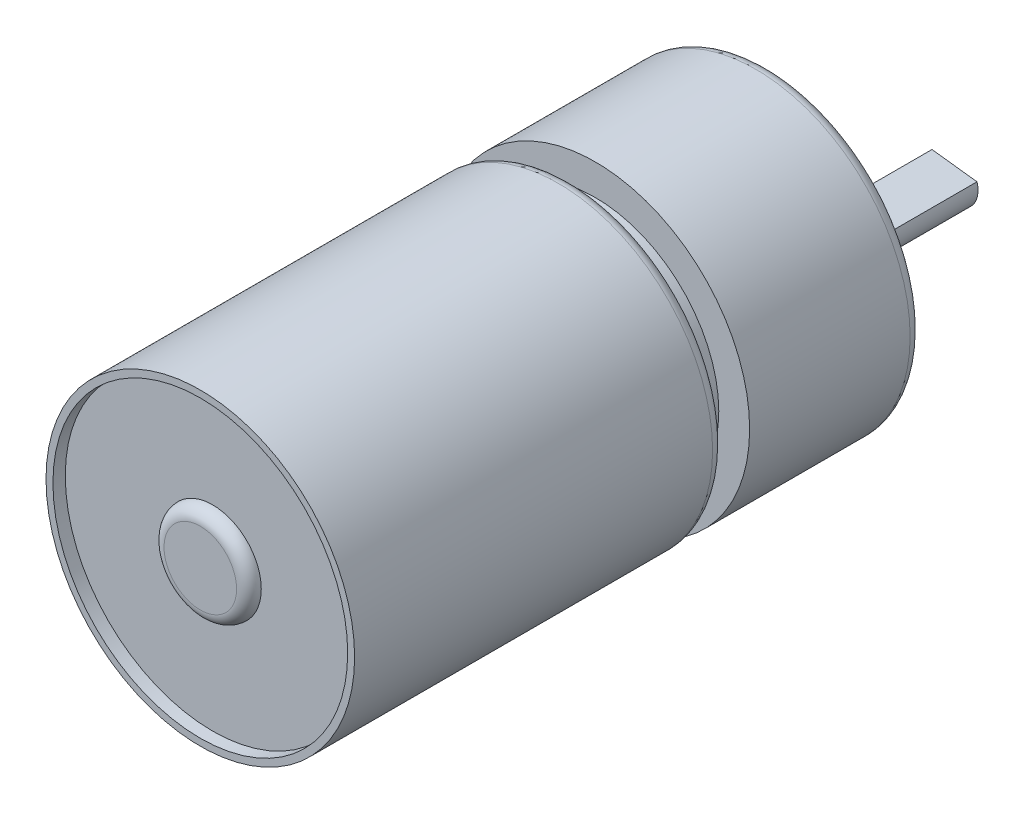
ISO-10303-21;
HEADER;
FILE_DESCRIPTION(('STEP AP214'),'2;1');
FILE_NAME('part.step','',(''),(''),'','','');
FILE_SCHEMA(('AUTOMOTIVE_DESIGN { 1 0 10303 214 1 1 1 1 }'));
ENDSEC;
DATA;
#1=APPLICATION_CONTEXT('core data for automotive mechanical design processes');
#2=APPLICATION_PROTOCOL_DEFINITION('international standard','automotive_design',2000,#1);
#3=PRODUCT_CONTEXT('',#1,'mechanical');
#4=PRODUCT('Part','Part','',(#3));
#5=PRODUCT_RELATED_PRODUCT_CATEGORY('part','',(#4));
#6=PRODUCT_DEFINITION_FORMATION('','',#4);
#7=PRODUCT_DEFINITION_CONTEXT('part definition',#1,'design');
#8=PRODUCT_DEFINITION('design','',#6,#7);
#9=PRODUCT_DEFINITION_SHAPE('','',#8);
#10=(LENGTH_UNIT() NAMED_UNIT(*) SI_UNIT(.MILLI.,.METRE.));
#11=(NAMED_UNIT(*) PLANE_ANGLE_UNIT() SI_UNIT($,.RADIAN.));
#12=(NAMED_UNIT(*) SI_UNIT($,.STERADIAN.) SOLID_ANGLE_UNIT());
#13=UNCERTAINTY_MEASURE_WITH_UNIT(LENGTH_MEASURE(1.E-05),#10,'distance_accuracy_value','');
#14=(GEOMETRIC_REPRESENTATION_CONTEXT(3) GLOBAL_UNCERTAINTY_ASSIGNED_CONTEXT((#13)) GLOBAL_UNIT_ASSIGNED_CONTEXT((#10,
#11,#12)) REPRESENTATION_CONTEXT('',''));
#15=CARTESIAN_POINT('',(0.,0.,0.));
#16=DIRECTION('',(0.,0.,1.));
#17=DIRECTION('',(1.,0.,0.));
#18=AXIS2_PLACEMENT_3D('',#15,#16,#17);
#19=CARTESIAN_POINT('',(0.,0.,14.));
#20=DIRECTION('',(0.,0.,-1.));
#21=DIRECTION('',(-1.,0.,0.));
#22=AXIS2_PLACEMENT_3D('',#19,#20,#21);
#23=CYLINDRICAL_SURFACE('',#22,12.5);
#24=CARTESIAN_POINT('',(0.,0.,0.999999999999999));
#25=DIRECTION('',(0.,0.,1.));
#26=DIRECTION('',(1.,0.,0.));
#27=AXIS2_PLACEMENT_3D('',#24,#25,#26);
#28=CIRCLE('',#27,12.5);
#29=CARTESIAN_POINT('',(12.5,0.,0.999999999999999));
#30=VERTEX_POINT('',#29);
#31=EDGE_CURVE('E144',#30,#30,#28,.T.);
#32=ORIENTED_EDGE('',*,*,#31,.T.);
#33=EDGE_LOOP('',(#32));
#34=FACE_BOUND('',#33,.T.);
#35=CARTESIAN_POINT('',(0.,0.,14.));
#36=DIRECTION('',(0.,0.,1.));
#37=DIRECTION('',(1.,0.,0.));
#38=AXIS2_PLACEMENT_3D('',#35,#36,#37);
#39=CIRCLE('',#38,12.5);
#40=CARTESIAN_POINT('',(12.5,0.,14.));
#41=VERTEX_POINT('',#40);
#42=EDGE_CURVE('E132',#41,#41,#39,.T.);
#43=ORIENTED_EDGE('',*,*,#42,.F.);
#44=EDGE_LOOP('',(#43));
#45=FACE_BOUND('',#44,.T.);
#46=ADVANCED_FACE('F42',(#34,#45),#23,.T.);
#47=CARTESIAN_POINT('',(0.,0.,14.));
#48=DIRECTION('',(0.,0.,1.));
#49=DIRECTION('',(1.,0.,0.));
#50=AXIS2_PLACEMENT_3D('',#47,#48,#49);
#51=PLANE('',#50);
#52=CARTESIAN_POINT('',(0.,0.,14.));
#53=DIRECTION('',(0.,0.,1.));
#54=DIRECTION('',(1.,0.,0.));
#55=AXIS2_PLACEMENT_3D('',#52,#53,#54);
#56=CIRCLE('',#55,10.);
#57=CARTESIAN_POINT('',(10.,0.,14.));
#58=VERTEX_POINT('',#57);
#59=EDGE_CURVE('E133',#58,#58,#56,.T.);
#60=ORIENTED_EDGE('',*,*,#59,.F.);
#61=EDGE_LOOP('',(#60));
#62=FACE_BOUND('',#61,.T.);
#63=ORIENTED_EDGE('',*,*,#42,.T.);
#64=EDGE_LOOP('',(#63));
#65=FACE_BOUND('',#64,.T.);
#66=ADVANCED_FACE('F190',(#62,#65),#51,.T.);
#67=CARTESIAN_POINT('',(0.,0.,0.));
#68=DIRECTION('',(0.,0.,1.));
#69=DIRECTION('',(1.,0.,0.));
#70=AXIS2_PLACEMENT_3D('',#67,#68,#69);
#71=PLANE('',#70);
#72=CARTESIAN_POINT('',(0.,-3.,0.));
#73=DIRECTION('',(0.,0.,1.));
#74=DIRECTION('',(1.,0.,0.));
#75=AXIS2_PLACEMENT_3D('',#72,#73,#74);
#76=CIRCLE('',#75,4.25);
#77=CARTESIAN_POINT('',(4.25,-3.,0.));
#78=VERTEX_POINT('',#77);
#79=EDGE_CURVE('E168',#78,#78,#76,.F.);
#80=ORIENTED_EDGE('',*,*,#79,.F.);
#81=EDGE_LOOP('',(#80));
#82=FACE_BOUND('',#81,.T.);
#83=CARTESIAN_POINT('',(9.49999999999999,0.,0.));
#84=DIRECTION('',(0.,0.,-1.));
#85=DIRECTION('',(-1.,0.,0.));
#86=AXIS2_PLACEMENT_3D('',#83,#84,#85);
#87=CIRCLE('',#86,1.);
#88=CARTESIAN_POINT('',(8.49999999999999,0.,0.));
#89=VERTEX_POINT('',#88);
#90=EDGE_CURVE('E106',#89,#89,#87,.T.);
#91=ORIENTED_EDGE('',*,*,#90,.F.);
#92=EDGE_LOOP('',(#91));
#93=FACE_BOUND('',#92,.T.);
#94=CARTESIAN_POINT('',(-9.5,0.,0.));
#95=DIRECTION('',(0.,0.,-1.));
#96=DIRECTION('',(-1.,0.,0.));
#97=AXIS2_PLACEMENT_3D('',#94,#95,#96);
#98=CIRCLE('',#97,1.);
#99=CARTESIAN_POINT('',(-10.5,0.,0.));
#100=VERTEX_POINT('',#99);
#101=EDGE_CURVE('E110',#100,#100,#98,.T.);
#102=ORIENTED_EDGE('',*,*,#101,.F.);
#103=EDGE_LOOP('',(#102));
#104=FACE_BOUND('',#103,.T.);
#105=CARTESIAN_POINT('',(0.,0.,0.));
#106=DIRECTION('',(0.,0.,1.));
#107=DIRECTION('',(1.,0.,0.));
#108=AXIS2_PLACEMENT_3D('',#105,#106,#107);
#109=CIRCLE('',#108,11.5);
#110=CARTESIAN_POINT('',(11.5,0.,0.));
#111=VERTEX_POINT('',#110);
#112=EDGE_CURVE('E148',#111,#111,#109,.F.);
#113=ORIENTED_EDGE('',*,*,#112,.T.);
#114=EDGE_LOOP('',(#113));
#115=FACE_BOUND('',#114,.T.);
#116=ADVANCED_FACE('F196',(#82,#93,#104,#115),#71,.F.);
#117=CARTESIAN_POINT('',(0.,0.,16.));
#118=DIRECTION('',(0.,0.,-1.));
#119=DIRECTION('',(-1.,0.,0.));
#120=AXIS2_PLACEMENT_3D('',#117,#118,#119);
#121=CYLINDRICAL_SURFACE('',#120,10.);
#122=CARTESIAN_POINT('',(0.,0.,15.));
#123=DIRECTION('',(0.,0.,1.));
#124=DIRECTION('',(1.,0.,0.));
#125=AXIS2_PLACEMENT_3D('',#122,#123,#124);
#126=CIRCLE('',#125,10.);
#127=CARTESIAN_POINT('',(10.,0.,15.));
#128=VERTEX_POINT('',#127);
#129=EDGE_CURVE('E164',#128,#128,#126,.F.);
#130=ORIENTED_EDGE('',*,*,#129,.T.);
#131=EDGE_LOOP('',(#130));
#132=FACE_BOUND('',#131,.T.);
#133=ORIENTED_EDGE('',*,*,#59,.T.);
#134=EDGE_LOOP('',(#133));
#135=FACE_BOUND('',#134,.T.);
#136=ADVANCED_FACE('F247',(#132,#135),#121,.T.);
#137=CARTESIAN_POINT('',(0.,0.,46.));
#138=DIRECTION('',(0.,0.,-1.));
#139=DIRECTION('',(-1.,0.,0.));
#140=AXIS2_PLACEMENT_3D('',#137,#138,#139);
#141=CYLINDRICAL_SURFACE('',#140,12.5);
#142=CARTESIAN_POINT('',(0.,0.,17.));
#143=DIRECTION('',(0.,0.,1.));
#144=DIRECTION('',(1.,0.,0.));
#145=AXIS2_PLACEMENT_3D('',#142,#143,#144);
#146=CIRCLE('',#145,12.5);
#147=CARTESIAN_POINT('',(12.5,0.,17.));
#148=VERTEX_POINT('',#147);
#149=EDGE_CURVE('E152',#148,#148,#146,.T.);
#150=ORIENTED_EDGE('',*,*,#149,.T.);
#151=EDGE_LOOP('',(#150));
#152=FACE_BOUND('',#151,.T.);
#153=CARTESIAN_POINT('',(0.,0.,46.));
#154=DIRECTION('',(0.,0.,1.));
#155=DIRECTION('',(1.,0.,0.));
#156=AXIS2_PLACEMENT_3D('',#153,#154,#155);
#157=CIRCLE('',#156,12.5);
#158=CARTESIAN_POINT('',(12.5,0.,46.));
#159=VERTEX_POINT('',#158);
#160=EDGE_CURVE('E125',#159,#159,#157,.T.);
#161=ORIENTED_EDGE('',*,*,#160,.F.);
#162=EDGE_LOOP('',(#161));
#163=FACE_BOUND('',#162,.T.);
#164=ADVANCED_FACE('F241',(#152,#163),#141,.T.);
#165=CARTESIAN_POINT('',(0.,0.,46.));
#166=DIRECTION('',(0.,0.,1.));
#167=DIRECTION('',(1.,0.,0.));
#168=AXIS2_PLACEMENT_3D('',#165,#166,#167);
#169=PLANE('',#168);
#170=CARTESIAN_POINT('',(0.,0.,46.));
#171=DIRECTION('',(0.,0.,1.));
#172=DIRECTION('',(1.,0.,0.));
#173=AXIS2_PLACEMENT_3D('',#170,#171,#172);
#174=CIRCLE('',#173,11.938790888998);
#175=CARTESIAN_POINT('',(11.938790888998,0.,46.));
#176=VERTEX_POINT('',#175);
#177=EDGE_CURVE('E120',#176,#176,#174,.T.);
#178=ORIENTED_EDGE('',*,*,#177,.F.);
#179=EDGE_LOOP('',(#178));
#180=FACE_BOUND('',#179,.T.);
#181=ORIENTED_EDGE('',*,*,#160,.T.);
#182=EDGE_LOOP('',(#181));
#183=FACE_BOUND('',#182,.T.);
#184=ADVANCED_FACE('F231',(#180,#183),#169,.T.);
#185=CARTESIAN_POINT('',(0.,0.,16.));
#186=DIRECTION('',(0.,0.,1.));
#187=DIRECTION('',(1.,0.,0.));
#188=AXIS2_PLACEMENT_3D('',#185,#186,#187);
#189=PLANE('',#188);
#190=CARTESIAN_POINT('',(0.,0.,16.));
#191=DIRECTION('',(0.,0.,1.));
#192=DIRECTION('',(1.,0.,0.));
#193=AXIS2_PLACEMENT_3D('',#190,#191,#192);
#194=CIRCLE('',#193,11.5);
#195=CARTESIAN_POINT('',(11.5,0.,16.));
#196=VERTEX_POINT('',#195);
#197=EDGE_CURVE('E160',#196,#196,#194,.F.);
#198=ORIENTED_EDGE('',*,*,#197,.T.);
#199=EDGE_LOOP('',(#198));
#200=FACE_BOUND('',#199,.T.);
#201=CARTESIAN_POINT('',(0.,0.,16.));
#202=DIRECTION('',(0.,0.,1.));
#203=DIRECTION('',(1.,0.,0.));
#204=AXIS2_PLACEMENT_3D('',#201,#202,#203);
#205=CIRCLE('',#204,11.);
#206=CARTESIAN_POINT('',(11.,0.,16.));
#207=VERTEX_POINT('',#206);
#208=EDGE_CURVE('E156',#207,#207,#205,.T.);
#209=ORIENTED_EDGE('',*,*,#208,.T.);
#210=EDGE_LOOP('',(#209));
#211=FACE_BOUND('',#210,.T.);
#212=ADVANCED_FACE('F228',(#200,#211),#189,.F.);
#213=CARTESIAN_POINT('',(0.,0.,45.));
#214=DIRECTION('',(0.,0.,1.));
#215=DIRECTION('',(1.,0.,0.));
#216=AXIS2_PLACEMENT_3D('',#213,#214,#215);
#217=CYLINDRICAL_SURFACE('',#216,11.938790888998);
#218=CARTESIAN_POINT('',(0.,0.,45.));
#219=DIRECTION('',(0.,0.,1.));
#220=DIRECTION('',(1.,0.,0.));
#221=AXIS2_PLACEMENT_3D('',#218,#219,#220);
#222=CIRCLE('',#221,11.938790888998);
#223=CARTESIAN_POINT('',(11.938790888998,0.,45.));
#224=VERTEX_POINT('',#223);
#225=EDGE_CURVE('E121',#224,#224,#222,.T.);
#226=ORIENTED_EDGE('',*,*,#225,.F.);
#227=EDGE_LOOP('',(#226));
#228=FACE_BOUND('',#227,.T.);
#229=ORIENTED_EDGE('',*,*,#177,.T.);
#230=EDGE_LOOP('',(#229));
#231=FACE_BOUND('',#230,.T.);
#232=ADVANCED_FACE('F230',(#228,#231),#217,.F.);
#233=CARTESIAN_POINT('',(0.,0.,45.));
#234=DIRECTION('',(0.,0.,1.));
#235=DIRECTION('',(1.,0.,0.));
#236=AXIS2_PLACEMENT_3D('',#233,#234,#235);
#237=PLANE('',#236);
#238=CARTESIAN_POINT('',(0.,0.,45.));
#239=DIRECTION('',(0.,0.,1.));
#240=DIRECTION('',(1.,0.,0.));
#241=AXIS2_PLACEMENT_3D('',#238,#239,#240);
#242=CIRCLE('',#241,3.93894938876642);
#243=CARTESIAN_POINT('',(3.93894938876642,0.,45.));
#244=VERTEX_POINT('',#243);
#245=EDGE_CURVE('E105',#244,#244,#242,.T.);
#246=ORIENTED_EDGE('',*,*,#245,.F.);
#247=EDGE_LOOP('',(#246));
#248=FACE_BOUND('',#247,.T.);
#249=ORIENTED_EDGE('',*,*,#225,.T.);
#250=EDGE_LOOP('',(#249));
#251=FACE_BOUND('',#250,.T.);
#252=ADVANCED_FACE('F238',(#248,#251),#237,.T.);
#253=CARTESIAN_POINT('',(0.,0.,46.));
#254=DIRECTION('',(0.,0.,1.));
#255=DIRECTION('',(1.,0.,0.));
#256=AXIS2_PLACEMENT_3D('',#253,#254,#255);
#257=PLANE('',#256);
#258=CARTESIAN_POINT('',(0.,0.,46.));
#259=DIRECTION('',(0.,0.,1.));
#260=DIRECTION('',(1.,0.,0.));
#261=AXIS2_PLACEMENT_3D('',#258,#259,#260);
#262=CIRCLE('',#261,2.93894938876642);
#263=CARTESIAN_POINT('',(2.93894938876642,0.,46.));
#264=VERTEX_POINT('',#263);
#265=EDGE_CURVE('E137',#264,#264,#262,.T.);
#266=ORIENTED_EDGE('',*,*,#265,.T.);
#267=EDGE_LOOP('',(#266));
#268=FACE_BOUND('',#267,.T.);
#269=ADVANCED_FACE('F206',(#268),#257,.T.);
#270=CARTESIAN_POINT('',(0.,0.,45.));
#271=DIRECTION('',(0.,0.,1.));
#272=DIRECTION('',(1.,0.,0.));
#273=AXIS2_PLACEMENT_3D('',#270,#271,#272);
#274=TOROIDAL_SURFACE('',#273,2.93894938876642,1.);
#275=ORIENTED_EDGE('',*,*,#245,.T.);
#276=EDGE_LOOP('',(#275));
#277=FACE_BOUND('',#276,.T.);
#278=ORIENTED_EDGE('',*,*,#265,.F.);
#279=EDGE_LOOP('',(#278));
#280=FACE_BOUND('',#279,.T.);
#281=ADVANCED_FACE('F202',(#277,#280),#274,.T.);
#282=CARTESIAN_POINT('',(0.,0.,0.999999999999999));
#283=DIRECTION('',(0.,0.,1.));
#284=DIRECTION('',(1.,0.,0.));
#285=AXIS2_PLACEMENT_3D('',#282,#283,#284);
#286=TOROIDAL_SURFACE('',#285,11.5,1.);
#287=ORIENTED_EDGE('',*,*,#112,.F.);
#288=EDGE_LOOP('',(#287));
#289=FACE_BOUND('',#288,.T.);
#290=ORIENTED_EDGE('',*,*,#31,.F.);
#291=EDGE_LOOP('',(#290));
#292=FACE_BOUND('',#291,.T.);
#293=ADVANCED_FACE('F205',(#289,#292),#286,.T.);
#294=CARTESIAN_POINT('',(0.,0.,17.));
#295=DIRECTION('',(0.,0.,1.));
#296=DIRECTION('',(1.,0.,0.));
#297=AXIS2_PLACEMENT_3D('',#294,#295,#296);
#298=TOROIDAL_SURFACE('',#297,11.5,1.);
#299=ORIENTED_EDGE('',*,*,#197,.F.);
#300=EDGE_LOOP('',(#299));
#301=FACE_BOUND('',#300,.T.);
#302=ORIENTED_EDGE('',*,*,#149,.F.);
#303=EDGE_LOOP('',(#302));
#304=FACE_BOUND('',#303,.T.);
#305=ADVANCED_FACE('F210',(#301,#304),#298,.T.);
#306=CARTESIAN_POINT('',(0.,0.,15.));
#307=DIRECTION('',(0.,0.,1.));
#308=DIRECTION('',(1.,0.,0.));
#309=AXIS2_PLACEMENT_3D('',#306,#307,#308);
#310=TOROIDAL_SURFACE('',#309,11.,1.);
#311=ORIENTED_EDGE('',*,*,#129,.F.);
#312=EDGE_LOOP('',(#311));
#313=FACE_BOUND('',#312,.T.);
#314=ORIENTED_EDGE('',*,*,#208,.F.);
#315=EDGE_LOOP('',(#314));
#316=FACE_BOUND('',#315,.T.);
#317=ADVANCED_FACE('F213',(#313,#316),#310,.F.);
#318=CARTESIAN_POINT('',(-9.5,0.,5.));
#319=DIRECTION('',(0.,0.,-1.));
#320=DIRECTION('',(-1.,0.,0.));
#321=AXIS2_PLACEMENT_3D('',#318,#319,#320);
#322=CYLINDRICAL_SURFACE('',#321,1.);
#323=CARTESIAN_POINT('',(-9.5,0.,5.));
#324=DIRECTION('',(0.,0.,-1.));
#325=DIRECTION('',(-1.,0.,0.));
#326=AXIS2_PLACEMENT_3D('',#323,#324,#325);
#327=CIRCLE('',#326,1.);
#328=CARTESIAN_POINT('',(-10.5,0.,5.));
#329=VERTEX_POINT('',#328);
#330=EDGE_CURVE('E97',#329,#329,#327,.T.);
#331=ORIENTED_EDGE('',*,*,#330,.F.);
#332=EDGE_LOOP('',(#331));
#333=FACE_BOUND('',#332,.T.);
#334=ORIENTED_EDGE('',*,*,#101,.T.);
#335=EDGE_LOOP('',(#334));
#336=FACE_BOUND('',#335,.T.);
#337=ADVANCED_FACE('F216',(#333,#336),#322,.F.);
#338=CARTESIAN_POINT('',(-9.5,0.,5.));
#339=DIRECTION('',(0.,0.,-1.));
#340=DIRECTION('',(-1.,0.,0.));
#341=AXIS2_PLACEMENT_3D('',#338,#339,#340);
#342=PLANE('',#341);
#343=ORIENTED_EDGE('',*,*,#330,.T.);
#344=EDGE_LOOP('',(#343));
#345=FACE_BOUND('',#344,.T.);
#346=ADVANCED_FACE('F221',(#345),#342,.T.);
#347=CARTESIAN_POINT('',(9.49999999999999,0.,5.));
#348=DIRECTION('',(0.,0.,-1.));
#349=DIRECTION('',(-1.,0.,0.));
#350=AXIS2_PLACEMENT_3D('',#347,#348,#349);
#351=CYLINDRICAL_SURFACE('',#350,1.);
#352=CARTESIAN_POINT('',(9.49999999999999,0.,5.));
#353=DIRECTION('',(0.,0.,-1.));
#354=DIRECTION('',(-1.,0.,0.));
#355=AXIS2_PLACEMENT_3D('',#352,#353,#354);
#356=CIRCLE('',#355,1.);
#357=CARTESIAN_POINT('',(8.49999999999999,0.,5.));
#358=VERTEX_POINT('',#357);
#359=EDGE_CURVE('E101',#358,#358,#356,.T.);
#360=ORIENTED_EDGE('',*,*,#359,.F.);
#361=EDGE_LOOP('',(#360));
#362=FACE_BOUND('',#361,.T.);
#363=ORIENTED_EDGE('',*,*,#90,.T.);
#364=EDGE_LOOP('',(#363));
#365=FACE_BOUND('',#364,.T.);
#366=ADVANCED_FACE('F272',(#362,#365),#351,.F.);
#367=CARTESIAN_POINT('',(9.49999999999999,0.,5.));
#368=DIRECTION('',(0.,0.,-1.));
#369=DIRECTION('',(-1.,0.,0.));
#370=AXIS2_PLACEMENT_3D('',#367,#368,#369);
#371=PLANE('',#370);
#372=ORIENTED_EDGE('',*,*,#359,.T.);
#373=EDGE_LOOP('',(#372));
#374=FACE_BOUND('',#373,.T.);
#375=ADVANCED_FACE('F274',(#374),#371,.T.);
#376=CARTESIAN_POINT('',(0.,-3.,-3.));
#377=DIRECTION('',(0.,0.,1.));
#378=DIRECTION('',(1.,0.,0.));
#379=AXIS2_PLACEMENT_3D('',#376,#377,#378);
#380=CYLINDRICAL_SURFACE('',#379,4.25);
#381=CARTESIAN_POINT('',(0.,-3.,-2.5));
#382=DIRECTION('',(0.,0.,-1.));
#383=DIRECTION('',(-1.,0.,0.));
#384=AXIS2_PLACEMENT_3D('',#381,#382,#383);
#385=CIRCLE('',#384,4.25);
#386=CARTESIAN_POINT('',(-4.25,-3.,-2.5));
#387=VERTEX_POINT('',#386);
#388=EDGE_CURVE('E11',#387,#387,#385,.F.);
#389=ORIENTED_EDGE('',*,*,#388,.T.);
#390=EDGE_LOOP('',(#389));
#391=FACE_BOUND('',#390,.T.);
#392=ORIENTED_EDGE('',*,*,#79,.T.);
#393=EDGE_LOOP('',(#392));
#394=FACE_BOUND('',#393,.T.);
#395=ADVANCED_FACE('F185',(#391,#394),#380,.T.);
#396=CARTESIAN_POINT('',(0.,-3.,-3.));
#397=DIRECTION('',(0.,0.,-1.));
#398=DIRECTION('',(-1.,0.,0.));
#399=AXIS2_PLACEMENT_3D('',#396,#397,#398);
#400=PLANE('',#399);
#401=CARTESIAN_POINT('',(0.,-3.,-3.));
#402=DIRECTION('',(0.,0.,-1.));
#403=DIRECTION('',(-1.,0.,0.));
#404=AXIS2_PLACEMENT_3D('',#401,#402,#403);
#405=CIRCLE('',#404,2.);
#406=CARTESIAN_POINT('',(-2.,-3.,-3.));
#407=VERTEX_POINT('',#406);
#408=EDGE_CURVE('E93',#407,#407,#405,.T.);
#409=ORIENTED_EDGE('',*,*,#408,.F.);
#410=EDGE_LOOP('',(#409));
#411=FACE_BOUND('',#410,.T.);
#412=CARTESIAN_POINT('',(0.,-3.,-3.));
#413=DIRECTION('',(0.,0.,-1.));
#414=DIRECTION('',(-1.,0.,0.));
#415=AXIS2_PLACEMENT_3D('',#412,#413,#414);
#416=CIRCLE('',#415,3.75);
#417=CARTESIAN_POINT('',(-3.75,-3.,-3.));
#418=VERTEX_POINT('',#417);
#419=EDGE_CURVE('E51',#418,#418,#416,.T.);
#420=ORIENTED_EDGE('',*,*,#419,.T.);
#421=EDGE_LOOP('',(#420));
#422=FACE_BOUND('',#421,.T.);
#423=ADVANCED_FACE('F175',(#411,#422),#400,.T.);
#424=CARTESIAN_POINT('',(0.,-3.,-2.5));
#425=DIRECTION('',(0.,0.,-1.));
#426=DIRECTION('',(-1.,0.,0.));
#427=AXIS2_PLACEMENT_3D('',#424,#425,#426);
#428=TOROIDAL_SURFACE('',#427,3.75,0.5);
#429=ORIENTED_EDGE('',*,*,#388,.F.);
#430=EDGE_LOOP('',(#429));
#431=FACE_BOUND('',#430,.T.);
#432=ORIENTED_EDGE('',*,*,#419,.F.);
#433=EDGE_LOOP('',(#432));
#434=FACE_BOUND('',#433,.T.);
#435=ADVANCED_FACE('F44',(#431,#434),#428,.T.);
#436=CARTESIAN_POINT('',(0.,-3.,-15.));
#437=DIRECTION('',(0.,0.,1.));
#438=DIRECTION('',(1.,0.,0.));
#439=AXIS2_PLACEMENT_3D('',#436,#437,#438);
#440=CYLINDRICAL_SURFACE('',#439,2.);
#441=CARTESIAN_POINT('',(0.,-3.,-15.));
#442=DIRECTION('',(0.,0.,-1.));
#443=DIRECTION('',(-1.,0.,0.));
#444=AXIS2_PLACEMENT_3D('',#441,#442,#443);
#445=CIRCLE('',#444,2.);
#446=CARTESIAN_POINT('',(1.91906623518634,-2.4368083940898,-15.));
#447=VERTEX_POINT('',#446);
#448=CARTESIAN_POINT('',(-1.73196335624444,-1.99984854515604,-15.));
#449=VERTEX_POINT('',#448);
#450=EDGE_CURVE('E74',#447,#449,#445,.T.);
#451=ORIENTED_EDGE('',*,*,#450,.F.);
#452=DIRECTION('',(0.,0.,1.));
#453=VECTOR('',#452,1.);
#454=CARTESIAN_POINT('',(1.91906623518634,-2.4368083940898,-123.131648685362));
#455=LINE('',#454,#453);
#456=CARTESIAN_POINT('',(1.91906623518634,-2.4368083940898,-6.));
#457=VERTEX_POINT('',#456);
#458=EDGE_CURVE('E71',#447,#457,#455,.T.);
#459=ORIENTED_EDGE('',*,*,#458,.T.);
#460=CARTESIAN_POINT('',(0.,-3.,-6.));
#461=DIRECTION('',(0.,0.,-1.));
#462=DIRECTION('',(-1.,0.,0.));
#463=AXIS2_PLACEMENT_3D('',#460,#461,#462);
#464=CIRCLE('',#463,2.);
#465=CARTESIAN_POINT('',(-1.73196335624444,-1.99984854515604,-6.));
#466=VERTEX_POINT('',#465);
#467=EDGE_CURVE('E58',#466,#457,#464,.T.);
#468=ORIENTED_EDGE('',*,*,#467,.F.);
#469=DIRECTION('',(0.,0.,1.));
#470=VECTOR('',#469,1.);
#471=CARTESIAN_POINT('',(-1.73196335624444,-1.99984854515604,-123.131648685362));
#472=LINE('',#471,#470);
#473=EDGE_CURVE('E78',#449,#466,#472,.T.);
#474=ORIENTED_EDGE('',*,*,#473,.F.);
#475=EDGE_LOOP('',(#451,#459,#468,#474));
#476=FACE_BOUND('',#475,.T.);
#477=ORIENTED_EDGE('',*,*,#408,.T.);
#478=EDGE_LOOP('',(#477));
#479=FACE_BOUND('',#478,.T.);
#480=ADVANCED_FACE('F72',(#476,#479),#440,.T.);
#481=CARTESIAN_POINT('',(0.,-3.,-15.));
#482=DIRECTION('',(0.,0.,-1.));
#483=DIRECTION('',(-1.,0.,0.));
#484=AXIS2_PLACEMENT_3D('',#481,#482,#483);
#485=PLANE('',#484);
#486=DIRECTION('',(-0.992914227259568,0.118833233169578,0.));
#487=VECTOR('',#486,1.);
#488=CARTESIAN_POINT('',(1.91906623518634,-2.4368083940898,-15.));
#489=LINE('',#488,#487);
#490=EDGE_CURVE('E65',#447,#449,#489,.T.);
#491=ORIENTED_EDGE('',*,*,#490,.F.);
#492=ORIENTED_EDGE('',*,*,#450,.T.);
#493=EDGE_LOOP('',(#491,#492));
#494=FACE_BOUND('',#493,.T.);
#495=ADVANCED_FACE('F183',(#494),#485,.T.);
#496=CARTESIAN_POINT('',(1.91906623518634,-2.4368083940898,-123.131648685362));
#497=DIRECTION('',(0.118833233169578,0.992914227259568,0.));
#498=DIRECTION('',(-0.992914227259568,0.118833233169578,0.));
#499=AXIS2_PLACEMENT_3D('',#496,#497,#498);
#500=PLANE('',#499);
#501=ORIENTED_EDGE('',*,*,#458,.F.);
#502=ORIENTED_EDGE('',*,*,#490,.T.);
#503=ORIENTED_EDGE('',*,*,#473,.T.);
#504=DIRECTION('',(-0.992914227259568,0.118833233169578,0.));
#505=VECTOR('',#504,1.);
#506=CARTESIAN_POINT('',(1.91906623518634,-2.4368083940898,-6.00000000000001));
#507=LINE('',#506,#505);
#508=EDGE_CURVE('E82',#457,#466,#507,.T.);
#509=ORIENTED_EDGE('',*,*,#508,.F.);
#510=EDGE_LOOP('',(#501,#502,#503,#509));
#511=FACE_BOUND('',#510,.T.);
#512=ADVANCED_FACE('F86',(#511),#500,.T.);
#513=CARTESIAN_POINT('',(0.,-3.,-6.));
#514=DIRECTION('',(0.,0.,-1.));
#515=DIRECTION('',(-1.,0.,0.));
#516=AXIS2_PLACEMENT_3D('',#513,#514,#515);
#517=PLANE('',#516);
#518=ORIENTED_EDGE('',*,*,#508,.T.);
#519=ORIENTED_EDGE('',*,*,#467,.T.);
#520=EDGE_LOOP('',(#518,#519));
#521=FACE_BOUND('',#520,.T.);
#522=ADVANCED_FACE('F81',(#521),#517,.T.);
#523=CLOSED_SHELL('',(#46,#66,#116,#136,#164,#184,#212,#232,#252,#269,#281,#293,#305,#317,#337,
#346,#366,#375,#395,#423,#435,#480,#495,#512,#522));
#524=MANIFOLD_SOLID_BREP('B2',#523);
#525=ADVANCED_BREP_SHAPE_REPRESENTATION('',(#18,#524),#14);
#526=SHAPE_DEFINITION_REPRESENTATION(#9,#525);
ENDSEC;
END-ISO-10303-21;
